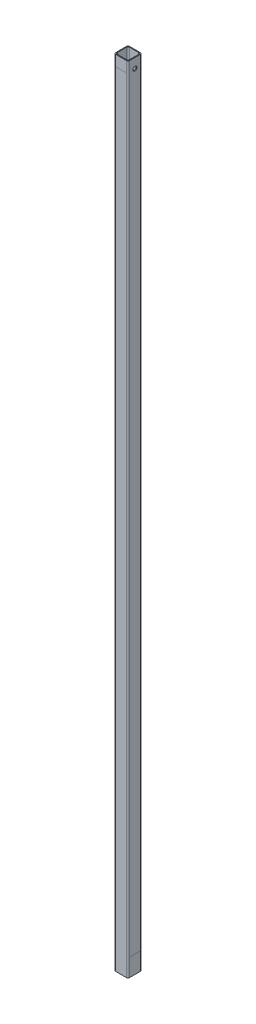
ISO-10303-21;
HEADER;
FILE_DESCRIPTION(('STEP AP214'),'2;1');
FILE_NAME('part.step','',(''),(''),'','','');
FILE_SCHEMA(('AUTOMOTIVE_DESIGN { 1 0 10303 214 1 1 1 1 }'));
ENDSEC;
DATA;
#1=APPLICATION_CONTEXT('core data for automotive mechanical design processes');
#2=APPLICATION_PROTOCOL_DEFINITION('international standard','automotive_design',2000,#1);
#3=PRODUCT_CONTEXT('',#1,'mechanical');
#4=PRODUCT('Part','Part','',(#3));
#5=PRODUCT_RELATED_PRODUCT_CATEGORY('part','',(#4));
#6=PRODUCT_DEFINITION_FORMATION('','',#4);
#7=PRODUCT_DEFINITION_CONTEXT('part definition',#1,'design');
#8=PRODUCT_DEFINITION('design','',#6,#7);
#9=PRODUCT_DEFINITION_SHAPE('','',#8);
#10=(LENGTH_UNIT() NAMED_UNIT(*) SI_UNIT(.MILLI.,.METRE.));
#11=(NAMED_UNIT(*) PLANE_ANGLE_UNIT() SI_UNIT($,.RADIAN.));
#12=(NAMED_UNIT(*) SI_UNIT($,.STERADIAN.) SOLID_ANGLE_UNIT());
#13=UNCERTAINTY_MEASURE_WITH_UNIT(LENGTH_MEASURE(1.E-05),#10,'distance_accuracy_value','');
#14=(GEOMETRIC_REPRESENTATION_CONTEXT(3) GLOBAL_UNCERTAINTY_ASSIGNED_CONTEXT((#13)) GLOBAL_UNIT_ASSIGNED_CONTEXT((#10,
#11,#12)) REPRESENTATION_CONTEXT('',''));
#15=CARTESIAN_POINT('',(0.,0.,0.));
#16=DIRECTION('',(0.,0.,1.));
#17=DIRECTION('',(1.,0.,0.));
#18=AXIS2_PLACEMENT_3D('',#15,#16,#17);
#19=CARTESIAN_POINT('',(11.3411,1303.02,11.3411));
#20=DIRECTION('',(-1.,0.,0.));
#21=DIRECTION('',(0.,0.,1.));
#22=AXIS2_PLACEMENT_3D('',#19,#20,#21);
#23=PLANE('',#22);
#24=CARTESIAN_POINT('',(11.3411,1287.145,0.));
#25=DIRECTION('',(1.,0.,0.));
#26=DIRECTION('',(0.,0.,-1.));
#27=AXIS2_PLACEMENT_3D('',#24,#25,#26);
#28=CIRCLE('',#27,3.3782);
#29=CARTESIAN_POINT('',(11.3411,1287.145,-3.3782));
#30=VERTEX_POINT('',#29);
#31=EDGE_CURVE('E350',#30,#30,#28,.T.);
#32=ORIENTED_EDGE('',*,*,#31,.F.);
#33=EDGE_LOOP('',(#32));
#34=FACE_BOUND('',#33,.T.);
#35=DIRECTION('',(0.,0.,1.));
#36=VECTOR('',#35,1.);
#37=CARTESIAN_POINT('',(11.3411,29.0055034620877,11.3411));
#38=LINE('',#37,#36);
#39=CARTESIAN_POINT('',(11.3411,29.0055034620877,-8.8011));
#40=VERTEX_POINT('',#39);
#41=CARTESIAN_POINT('',(11.3411,29.0055034620877,8.8011));
#42=VERTEX_POINT('',#41);
#43=EDGE_CURVE('E11',#40,#42,#38,.T.);
#44=ORIENTED_EDGE('',*,*,#43,.F.);
#45=DIRECTION('',(0.,-1.,0.));
#46=VECTOR('',#45,1.);
#47=CARTESIAN_POINT('',(11.3411,1303.02,-8.8011));
#48=LINE('',#47,#46);
#49=CARTESIAN_POINT('',(11.3411,1303.02,-8.8011));
#50=VERTEX_POINT('',#49);
#51=EDGE_CURVE('E250',#40,#50,#48,.F.);
#52=ORIENTED_EDGE('',*,*,#51,.T.);
#53=DIRECTION('',(0.,0.,-1.));
#54=VECTOR('',#53,1.);
#55=CARTESIAN_POINT('',(11.3411,1303.02,11.3411));
#56=LINE('',#55,#54);
#57=CARTESIAN_POINT('',(11.3411,1303.02,8.8011));
#58=VERTEX_POINT('',#57);
#59=EDGE_CURVE('E304',#58,#50,#56,.T.);
#60=ORIENTED_EDGE('',*,*,#59,.F.);
#61=DIRECTION('',(0.,-1.,0.));
#62=VECTOR('',#61,1.);
#63=CARTESIAN_POINT('',(11.3411,1303.02,8.8011));
#64=LINE('',#63,#62);
#65=EDGE_CURVE('E254',#58,#42,#64,.T.);
#66=ORIENTED_EDGE('',*,*,#65,.T.);
#67=EDGE_LOOP('',(#44,#52,#60,#66));
#68=FACE_BOUND('',#67,.T.);
#69=ADVANCED_FACE('F37',(#34,#68),#23,.F.);
#70=CARTESIAN_POINT('',(-11.3411,1303.02,11.3411));
#71=DIRECTION('',(0.,0.,-1.));
#72=DIRECTION('',(-1.,0.,0.));
#73=AXIS2_PLACEMENT_3D('',#70,#71,#72);
#74=PLANE('',#73);
#75=DIRECTION('',(1.,0.,0.));
#76=VECTOR('',#75,1.);
#77=CARTESIAN_POINT('',(-11.3411,1285.4178,11.3411));
#78=LINE('',#77,#76);
#79=CARTESIAN_POINT('',(-8.8011,1285.4178,11.3411));
#80=VERTEX_POINT('',#79);
#81=CARTESIAN_POINT('',(8.8011,1285.4178,11.3411));
#82=VERTEX_POINT('',#81);
#83=EDGE_CURVE('E46',#80,#82,#78,.T.);
#84=ORIENTED_EDGE('',*,*,#83,.F.);
#85=DIRECTION('',(0.,-1.,0.));
#86=VECTOR('',#85,1.);
#87=CARTESIAN_POINT('',(-8.8011,1303.02,11.3411));
#88=LINE('',#87,#86);
#89=CARTESIAN_POINT('',(-8.8011,0.,11.3411));
#90=VERTEX_POINT('',#89);
#91=EDGE_CURVE('E225',#80,#90,#88,.T.);
#92=ORIENTED_EDGE('',*,*,#91,.T.);
#93=DIRECTION('',(1.,0.,0.));
#94=VECTOR('',#93,1.);
#95=CARTESIAN_POINT('',(-11.3411,0.,11.3411));
#96=LINE('',#95,#94);
#97=CARTESIAN_POINT('',(8.8011,0.,11.3411));
#98=VERTEX_POINT('',#97);
#99=EDGE_CURVE('E205',#90,#98,#96,.T.);
#100=ORIENTED_EDGE('',*,*,#99,.T.);
#101=DIRECTION('',(0.,-1.,0.));
#102=VECTOR('',#101,1.);
#103=CARTESIAN_POINT('',(8.8011,1303.02,11.3411));
#104=LINE('',#103,#102);
#105=EDGE_CURVE('E222',#98,#82,#104,.F.);
#106=ORIENTED_EDGE('',*,*,#105,.T.);
#107=EDGE_LOOP('',(#84,#92,#100,#106));
#108=FACE_BOUND('',#107,.T.);
#109=ADVANCED_FACE('F300',(#108),#74,.F.);
#110=CARTESIAN_POINT('',(-11.3411,1303.02,-11.3411));
#111=DIRECTION('',(0.,0.,1.));
#112=DIRECTION('',(1.,0.,0.));
#113=AXIS2_PLACEMENT_3D('',#110,#111,#112);
#114=PLANE('',#113);
#115=DIRECTION('',(-1.,0.,0.));
#116=VECTOR('',#115,1.);
#117=CARTESIAN_POINT('',(-11.3411,241.3,-11.3411));
#118=LINE('',#117,#116);
#119=CARTESIAN_POINT('',(8.8011,241.3,-11.3411));
#120=VERTEX_POINT('',#119);
#121=CARTESIAN_POINT('',(-8.8011,241.3,-11.3411));
#122=VERTEX_POINT('',#121);
#123=EDGE_CURVE('E281',#120,#122,#118,.T.);
#124=ORIENTED_EDGE('',*,*,#123,.F.);
#125=DIRECTION('',(0.,-1.,0.));
#126=VECTOR('',#125,1.);
#127=CARTESIAN_POINT('',(8.8011,1303.02,-11.3411));
#128=LINE('',#127,#126);
#129=CARTESIAN_POINT('',(8.8011,0.,-11.3411));
#130=VERTEX_POINT('',#129);
#131=EDGE_CURVE('E260',#120,#130,#128,.T.);
#132=ORIENTED_EDGE('',*,*,#131,.T.);
#133=DIRECTION('',(-1.,0.,0.));
#134=VECTOR('',#133,1.);
#135=CARTESIAN_POINT('',(-11.3411,0.,-11.3411));
#136=LINE('',#135,#134);
#137=CARTESIAN_POINT('',(-8.8011,0.,-11.3411));
#138=VERTEX_POINT('',#137);
#139=EDGE_CURVE('E310',#130,#138,#136,.T.);
#140=ORIENTED_EDGE('',*,*,#139,.T.);
#141=DIRECTION('',(0.,-1.,0.));
#142=VECTOR('',#141,1.);
#143=CARTESIAN_POINT('',(-8.8011,1303.02,-11.3411));
#144=LINE('',#143,#142);
#145=EDGE_CURVE('E257',#138,#122,#144,.F.);
#146=ORIENTED_EDGE('',*,*,#145,.T.);
#147=EDGE_LOOP('',(#124,#132,#140,#146));
#148=FACE_BOUND('',#147,.T.);
#149=ADVANCED_FACE('F362',(#148),#114,.F.);
#150=DIRECTION('',(1.,0.,0.));
#151=VECTOR('',#150,1.);
#152=CARTESIAN_POINT('',(-11.3411,258.9022,-11.3411));
#153=LINE('',#152,#151);
#154=CARTESIAN_POINT('',(-8.8011,258.9022,-11.3411));
#155=VERTEX_POINT('',#154);
#156=CARTESIAN_POINT('',(8.8011,258.9022,-11.3411));
#157=VERTEX_POINT('',#156);
#158=EDGE_CURVE('E278',#155,#157,#153,.T.);
#159=ORIENTED_EDGE('',*,*,#158,.F.);
#160=CARTESIAN_POINT('',(-8.8011,1303.02,-11.3411));
#161=VERTEX_POINT('',#160);
#162=EDGE_CURVE('E256',#155,#161,#144,.F.);
#163=ORIENTED_EDGE('',*,*,#162,.T.);
#164=DIRECTION('',(-1.,0.,0.));
#165=VECTOR('',#164,1.);
#166=CARTESIAN_POINT('',(-11.3411,1303.02,-11.3411));
#167=LINE('',#166,#165);
#168=CARTESIAN_POINT('',(8.8011,1303.02,-11.3411));
#169=VERTEX_POINT('',#168);
#170=EDGE_CURVE('E307',#169,#161,#167,.T.);
#171=ORIENTED_EDGE('',*,*,#170,.F.);
#172=EDGE_CURVE('E262',#169,#157,#128,.T.);
#173=ORIENTED_EDGE('',*,*,#172,.T.);
#174=EDGE_LOOP('',(#159,#163,#171,#173));
#175=FACE_BOUND('',#174,.T.);
#176=ADVANCED_FACE('F374',(#175),#114,.F.);
#177=CARTESIAN_POINT('',(0.,1303.02,0.));
#178=DIRECTION('',(0.,-1.,0.));
#179=DIRECTION('',(0.,0.,-1.));
#180=AXIS2_PLACEMENT_3D('',#177,#178,#179);
#181=PLANE('',#180);
#182=DIRECTION('',(0.,0.,1.));
#183=VECTOR('',#182,1.);
#184=CARTESIAN_POINT('',(-11.3411,1303.02,11.3411));
#185=LINE('',#184,#183);
#186=CARTESIAN_POINT('',(-11.3411,1303.02,-8.8011));
#187=VERTEX_POINT('',#186);
#188=CARTESIAN_POINT('',(-11.3411,1303.02,8.8011));
#189=VERTEX_POINT('',#188);
#190=EDGE_CURVE('E202',#187,#189,#185,.T.);
#191=ORIENTED_EDGE('',*,*,#190,.T.);
#192=CARTESIAN_POINT('',(-8.8011,1303.02,8.8011));
#193=DIRECTION('',(0.,-1.,0.));
#194=DIRECTION('',(0.,0.,-1.));
#195=AXIS2_PLACEMENT_3D('',#192,#193,#194);
#196=CIRCLE('',#195,2.54);
#197=CARTESIAN_POINT('',(-8.8011,1303.02,11.3411));
#198=VERTEX_POINT('',#197);
#199=EDGE_CURVE('E248',#189,#198,#196,.F.);
#200=ORIENTED_EDGE('',*,*,#199,.T.);
#201=DIRECTION('',(1.,0.,0.));
#202=VECTOR('',#201,1.);
#203=CARTESIAN_POINT('',(-11.3411,1303.02,11.3411));
#204=LINE('',#203,#202);
#205=CARTESIAN_POINT('',(8.8011,1303.02,11.3411));
#206=VERTEX_POINT('',#205);
#207=EDGE_CURVE('E197',#198,#206,#204,.T.);
#208=ORIENTED_EDGE('',*,*,#207,.T.);
#209=CARTESIAN_POINT('',(8.8011,1303.02,8.8011));
#210=DIRECTION('',(0.,-1.,0.));
#211=DIRECTION('',(0.,0.,-1.));
#212=AXIS2_PLACEMENT_3D('',#209,#210,#211);
#213=CIRCLE('',#212,2.54);
#214=EDGE_CURVE('E246',#206,#58,#213,.F.);
#215=ORIENTED_EDGE('',*,*,#214,.T.);
#216=ORIENTED_EDGE('',*,*,#59,.T.);
#217=CARTESIAN_POINT('',(8.8011,1303.02,-8.8011));
#218=DIRECTION('',(0.,-1.,0.));
#219=DIRECTION('',(0.,0.,-1.));
#220=AXIS2_PLACEMENT_3D('',#217,#218,#219);
#221=CIRCLE('',#220,2.54);
#222=EDGE_CURVE('E244',#50,#169,#221,.F.);
#223=ORIENTED_EDGE('',*,*,#222,.T.);
#224=ORIENTED_EDGE('',*,*,#170,.T.);
#225=CARTESIAN_POINT('',(-8.8011,1303.02,-8.8011));
#226=DIRECTION('',(0.,-1.,0.));
#227=DIRECTION('',(0.,0.,-1.));
#228=AXIS2_PLACEMENT_3D('',#225,#226,#227);
#229=CIRCLE('',#228,2.54);
#230=EDGE_CURVE('E242',#161,#187,#229,.F.);
#231=ORIENTED_EDGE('',*,*,#230,.T.);
#232=EDGE_LOOP('',(#191,#200,#208,#215,#216,#223,#224,#231));
#233=FACE_BOUND('',#232,.T.);
#234=DIRECTION('',(0.,0.,-1.));
#235=VECTOR('',#234,1.);
#236=CARTESIAN_POINT('',(10.0711,1303.02,10.0711));
#237=LINE('',#236,#235);
#238=CARTESIAN_POINT('',(10.0711,1303.02,7.5311));
#239=VERTEX_POINT('',#238);
#240=CARTESIAN_POINT('',(10.0711,1303.02,-7.5311));
#241=VERTEX_POINT('',#240);
#242=EDGE_CURVE('E326',#239,#241,#237,.T.);
#243=ORIENTED_EDGE('',*,*,#242,.F.);
#244=CARTESIAN_POINT('',(7.5311,1303.02,7.5311));
#245=DIRECTION('',(0.,-1.,0.));
#246=DIRECTION('',(0.,0.,-1.));
#247=AXIS2_PLACEMENT_3D('',#244,#245,#246);
#248=CIRCLE('',#247,2.54);
#249=CARTESIAN_POINT('',(7.5311,1303.02,10.0711));
#250=VERTEX_POINT('',#249);
#251=EDGE_CURVE('E183',#239,#250,#248,.T.);
#252=ORIENTED_EDGE('',*,*,#251,.T.);
#253=DIRECTION('',(1.,0.,0.));
#254=VECTOR('',#253,1.);
#255=CARTESIAN_POINT('',(-10.0711,1303.02,10.0711));
#256=LINE('',#255,#254);
#257=CARTESIAN_POINT('',(-7.5311,1303.02,10.0711));
#258=VERTEX_POINT('',#257);
#259=EDGE_CURVE('E319',#258,#250,#256,.T.);
#260=ORIENTED_EDGE('',*,*,#259,.F.);
#261=CARTESIAN_POINT('',(-7.5311,1303.02,7.5311));
#262=DIRECTION('',(0.,-1.,0.));
#263=DIRECTION('',(0.,0.,-1.));
#264=AXIS2_PLACEMENT_3D('',#261,#262,#263);
#265=CIRCLE('',#264,2.54);
#266=CARTESIAN_POINT('',(-10.0711,1303.02,7.5311));
#267=VERTEX_POINT('',#266);
#268=EDGE_CURVE('E268',#258,#267,#265,.T.);
#269=ORIENTED_EDGE('',*,*,#268,.T.);
#270=DIRECTION('',(0.,0.,1.));
#271=VECTOR('',#270,1.);
#272=CARTESIAN_POINT('',(-10.0711,1303.02,10.0711));
#273=LINE('',#272,#271);
#274=CARTESIAN_POINT('',(-10.0711,1303.02,-7.5311));
#275=VERTEX_POINT('',#274);
#276=EDGE_CURVE('E335',#275,#267,#273,.T.);
#277=ORIENTED_EDGE('',*,*,#276,.F.);
#278=CARTESIAN_POINT('',(-7.5311,1303.02,-7.5311));
#279=DIRECTION('',(0.,-1.,0.));
#280=DIRECTION('',(0.,0.,-1.));
#281=AXIS2_PLACEMENT_3D('',#278,#279,#280);
#282=CIRCLE('',#281,2.54);
#283=CARTESIAN_POINT('',(-7.5311,1303.02,-10.0711));
#284=VERTEX_POINT('',#283);
#285=EDGE_CURVE('E182',#275,#284,#282,.T.);
#286=ORIENTED_EDGE('',*,*,#285,.T.);
#287=DIRECTION('',(-1.,0.,0.));
#288=VECTOR('',#287,1.);
#289=CARTESIAN_POINT('',(-10.0711,1303.02,-10.0711));
#290=LINE('',#289,#288);
#291=CARTESIAN_POINT('',(7.5311,1303.02,-10.0711));
#292=VERTEX_POINT('',#291);
#293=EDGE_CURVE('E337',#292,#284,#290,.T.);
#294=ORIENTED_EDGE('',*,*,#293,.F.);
#295=CARTESIAN_POINT('',(7.5311,1303.02,-7.5311));
#296=DIRECTION('',(0.,-1.,0.));
#297=DIRECTION('',(0.,0.,-1.));
#298=AXIS2_PLACEMENT_3D('',#295,#296,#297);
#299=CIRCLE('',#298,2.54);
#300=EDGE_CURVE('E276',#292,#241,#299,.T.);
#301=ORIENTED_EDGE('',*,*,#300,.T.);
#302=EDGE_LOOP('',(#243,#252,#260,#269,#277,#286,#294,#301));
#303=FACE_BOUND('',#302,.T.);
#304=ADVANCED_FACE('F375',(#233,#303),#181,.F.);
#305=CARTESIAN_POINT('',(0.,0.,0.));
#306=DIRECTION('',(0.,-1.,0.));
#307=DIRECTION('',(0.,0.,-1.));
#308=AXIS2_PLACEMENT_3D('',#305,#306,#307);
#309=PLANE('',#308);
#310=ORIENTED_EDGE('',*,*,#99,.F.);
#311=CARTESIAN_POINT('',(-8.8011,0.,8.8011));
#312=DIRECTION('',(0.,-1.,0.));
#313=DIRECTION('',(0.,0.,-1.));
#314=AXIS2_PLACEMENT_3D('',#311,#312,#313);
#315=CIRCLE('',#314,2.54);
#316=CARTESIAN_POINT('',(-11.3411,0.,8.8011));
#317=VERTEX_POINT('',#316);
#318=EDGE_CURVE('E235',#90,#317,#315,.T.);
#319=ORIENTED_EDGE('',*,*,#318,.T.);
#320=DIRECTION('',(0.,0.,1.));
#321=VECTOR('',#320,1.);
#322=CARTESIAN_POINT('',(-11.3411,0.,11.3411));
#323=LINE('',#322,#321);
#324=CARTESIAN_POINT('',(-11.3411,0.,-8.8011));
#325=VERTEX_POINT('',#324);
#326=EDGE_CURVE('E305',#325,#317,#323,.T.);
#327=ORIENTED_EDGE('',*,*,#326,.F.);
#328=CARTESIAN_POINT('',(-8.8011,0.,-8.8011));
#329=DIRECTION('',(0.,-1.,0.));
#330=DIRECTION('',(0.,0.,-1.));
#331=AXIS2_PLACEMENT_3D('',#328,#329,#330);
#332=CIRCLE('',#331,2.54);
#333=EDGE_CURVE('E229',#325,#138,#332,.T.);
#334=ORIENTED_EDGE('',*,*,#333,.T.);
#335=ORIENTED_EDGE('',*,*,#139,.F.);
#336=CARTESIAN_POINT('',(8.8011,0.,-8.8011));
#337=DIRECTION('',(0.,-1.,0.));
#338=DIRECTION('',(0.,0.,-1.));
#339=AXIS2_PLACEMENT_3D('',#336,#337,#338);
#340=CIRCLE('',#339,2.54);
#341=CARTESIAN_POINT('',(11.3411,0.,-8.8011));
#342=VERTEX_POINT('',#341);
#343=EDGE_CURVE('E231',#130,#342,#340,.T.);
#344=ORIENTED_EDGE('',*,*,#343,.T.);
#345=DIRECTION('',(0.,0.,-1.));
#346=VECTOR('',#345,1.);
#347=CARTESIAN_POINT('',(11.3411,0.,11.3411));
#348=LINE('',#347,#346);
#349=CARTESIAN_POINT('',(11.3411,0.,8.8011));
#350=VERTEX_POINT('',#349);
#351=EDGE_CURVE('E315',#350,#342,#348,.T.);
#352=ORIENTED_EDGE('',*,*,#351,.F.);
#353=CARTESIAN_POINT('',(8.8011,0.,8.8011));
#354=DIRECTION('',(0.,-1.,0.));
#355=DIRECTION('',(0.,0.,-1.));
#356=AXIS2_PLACEMENT_3D('',#353,#354,#355);
#357=CIRCLE('',#356,2.54);
#358=EDGE_CURVE('E233',#350,#98,#357,.T.);
#359=ORIENTED_EDGE('',*,*,#358,.T.);
#360=EDGE_LOOP('',(#310,#319,#327,#334,#335,#344,#352,#359));
#361=FACE_BOUND('',#360,.T.);
#362=DIRECTION('',(0.,0.,1.));
#363=VECTOR('',#362,1.);
#364=CARTESIAN_POINT('',(-10.0711,0.,10.0711));
#365=LINE('',#364,#363);
#366=CARTESIAN_POINT('',(-10.0711,0.,-7.5311));
#367=VERTEX_POINT('',#366);
#368=CARTESIAN_POINT('',(-10.0711,0.,7.5311));
#369=VERTEX_POINT('',#368);
#370=EDGE_CURVE('E175',#367,#369,#365,.T.);
#371=ORIENTED_EDGE('',*,*,#370,.T.);
#372=CARTESIAN_POINT('',(-7.5311,0.,7.5311));
#373=DIRECTION('',(0.,-1.,0.));
#374=DIRECTION('',(0.,0.,-1.));
#375=AXIS2_PLACEMENT_3D('',#372,#373,#374);
#376=CIRCLE('',#375,2.54);
#377=CARTESIAN_POINT('',(-7.5311,0.,10.0711));
#378=VERTEX_POINT('',#377);
#379=EDGE_CURVE('E265',#369,#378,#376,.F.);
#380=ORIENTED_EDGE('',*,*,#379,.T.);
#381=DIRECTION('',(1.,0.,0.));
#382=VECTOR('',#381,1.);
#383=CARTESIAN_POINT('',(-10.0711,0.,10.0711));
#384=LINE('',#383,#382);
#385=CARTESIAN_POINT('',(7.5311,0.,10.0711));
#386=VERTEX_POINT('',#385);
#387=EDGE_CURVE('E193',#378,#386,#384,.T.);
#388=ORIENTED_EDGE('',*,*,#387,.T.);
#389=CARTESIAN_POINT('',(7.5311,0.,7.5311));
#390=DIRECTION('',(0.,-1.,0.));
#391=DIRECTION('',(0.,0.,-1.));
#392=AXIS2_PLACEMENT_3D('',#389,#390,#391);
#393=CIRCLE('',#392,2.54);
#394=CARTESIAN_POINT('',(10.0711,0.,7.5311));
#395=VERTEX_POINT('',#394);
#396=EDGE_CURVE('E270',#386,#395,#393,.F.);
#397=ORIENTED_EDGE('',*,*,#396,.T.);
#398=DIRECTION('',(0.,0.,-1.));
#399=VECTOR('',#398,1.);
#400=CARTESIAN_POINT('',(10.0711,0.,10.0711));
#401=LINE('',#400,#399);
#402=CARTESIAN_POINT('',(10.0711,0.,-7.5311));
#403=VERTEX_POINT('',#402);
#404=EDGE_CURVE('E329',#395,#403,#401,.T.);
#405=ORIENTED_EDGE('',*,*,#404,.T.);
#406=CARTESIAN_POINT('',(7.5311,0.,-7.5311));
#407=DIRECTION('',(0.,-1.,0.));
#408=DIRECTION('',(0.,0.,-1.));
#409=AXIS2_PLACEMENT_3D('',#406,#407,#408);
#410=CIRCLE('',#409,2.54);
#411=CARTESIAN_POINT('',(7.5311,0.,-10.0711));
#412=VERTEX_POINT('',#411);
#413=EDGE_CURVE('E274',#403,#412,#410,.F.);
#414=ORIENTED_EDGE('',*,*,#413,.T.);
#415=DIRECTION('',(-1.,0.,0.));
#416=VECTOR('',#415,1.);
#417=CARTESIAN_POINT('',(-10.0711,0.,-10.0711));
#418=LINE('',#417,#416);
#419=CARTESIAN_POINT('',(-7.5311,0.,-10.0711));
#420=VERTEX_POINT('',#419);
#421=EDGE_CURVE('E177',#412,#420,#418,.T.);
#422=ORIENTED_EDGE('',*,*,#421,.T.);
#423=CARTESIAN_POINT('',(-7.5311,0.,-7.5311));
#424=DIRECTION('',(0.,-1.,0.));
#425=DIRECTION('',(0.,0.,-1.));
#426=AXIS2_PLACEMENT_3D('',#423,#424,#425);
#427=CIRCLE('',#426,2.54);
#428=EDGE_CURVE('E172',#420,#367,#427,.F.);
#429=ORIENTED_EDGE('',*,*,#428,.T.);
#430=EDGE_LOOP('',(#371,#380,#388,#397,#405,#414,#422,#429));
#431=FACE_BOUND('',#430,.T.);
#432=ADVANCED_FACE('F174',(#361,#431),#309,.T.);
#433=EDGE_CURVE('E251',#342,#40,#48,.F.);
#434=ORIENTED_EDGE('',*,*,#433,.T.);
#435=ORIENTED_EDGE('',*,*,#43,.T.);
#436=EDGE_CURVE('E253',#42,#350,#64,.T.);
#437=ORIENTED_EDGE('',*,*,#436,.T.);
#438=ORIENTED_EDGE('',*,*,#351,.T.);
#439=EDGE_LOOP('',(#434,#435,#437,#438));
#440=FACE_BOUND('',#439,.T.);
#441=ADVANCED_FACE('F358',(#440),#23,.F.);
#442=EDGE_CURVE('E266',#157,#120,#128,.T.);
#443=ORIENTED_EDGE('',*,*,#442,.T.);
#444=ORIENTED_EDGE('',*,*,#123,.T.);
#445=EDGE_CURVE('E261',#122,#155,#144,.F.);
#446=ORIENTED_EDGE('',*,*,#445,.T.);
#447=ORIENTED_EDGE('',*,*,#158,.T.);
#448=EDGE_LOOP('',(#443,#444,#446,#447));
#449=FACE_BOUND('',#448,.T.);
#450=ADVANCED_FACE('F367',(#449),#114,.F.);
#451=CARTESIAN_POINT('',(-11.3411,1303.02,11.3411));
#452=DIRECTION('',(1.,0.,0.));
#453=DIRECTION('',(0.,0.,-1.));
#454=AXIS2_PLACEMENT_3D('',#451,#452,#453);
#455=PLANE('',#454);
#456=CARTESIAN_POINT('',(-11.3411,1287.145,0.));
#457=DIRECTION('',(1.,0.,0.));
#458=DIRECTION('',(0.,0.,-1.));
#459=AXIS2_PLACEMENT_3D('',#456,#457,#458);
#460=CIRCLE('',#459,3.3782);
#461=CARTESIAN_POINT('',(-11.3411,1287.145,-3.3782));
#462=VERTEX_POINT('',#461);
#463=EDGE_CURVE('E347',#462,#462,#460,.T.);
#464=ORIENTED_EDGE('',*,*,#463,.T.);
#465=EDGE_LOOP('',(#464));
#466=FACE_BOUND('',#465,.T.);
#467=ORIENTED_EDGE('',*,*,#326,.T.);
#468=DIRECTION('',(0.,-1.,0.));
#469=VECTOR('',#468,1.);
#470=CARTESIAN_POINT('',(-11.3411,1303.02,8.8011));
#471=LINE('',#470,#469);
#472=EDGE_CURVE('E240',#317,#189,#471,.F.);
#473=ORIENTED_EDGE('',*,*,#472,.T.);
#474=ORIENTED_EDGE('',*,*,#190,.F.);
#475=DIRECTION('',(0.,-1.,0.));
#476=VECTOR('',#475,1.);
#477=CARTESIAN_POINT('',(-11.3411,1303.02,-8.8011));
#478=LINE('',#477,#476);
#479=EDGE_CURVE('E237',#187,#325,#478,.T.);
#480=ORIENTED_EDGE('',*,*,#479,.T.);
#481=EDGE_LOOP('',(#467,#473,#474,#480));
#482=FACE_BOUND('',#481,.T.);
#483=ADVANCED_FACE('F372',(#466,#482),#455,.F.);
#484=EDGE_CURVE('E226',#198,#80,#88,.T.);
#485=ORIENTED_EDGE('',*,*,#484,.T.);
#486=ORIENTED_EDGE('',*,*,#83,.T.);
#487=EDGE_CURVE('E221',#82,#206,#104,.F.);
#488=ORIENTED_EDGE('',*,*,#487,.T.);
#489=ORIENTED_EDGE('',*,*,#207,.F.);
#490=EDGE_LOOP('',(#485,#486,#488,#489));
#491=FACE_BOUND('',#490,.T.);
#492=ADVANCED_FACE('F288',(#491),#74,.F.);
#493=CARTESIAN_POINT('',(10.0711,1303.02,10.0711));
#494=DIRECTION('',(-1.,0.,0.));
#495=DIRECTION('',(0.,0.,1.));
#496=AXIS2_PLACEMENT_3D('',#493,#494,#495);
#497=PLANE('',#496);
#498=CARTESIAN_POINT('',(10.0711,1287.145,0.));
#499=DIRECTION('',(-1.,0.,0.));
#500=DIRECTION('',(0.,0.,1.));
#501=AXIS2_PLACEMENT_3D('',#498,#499,#500);
#502=CIRCLE('',#501,3.3782);
#503=CARTESIAN_POINT('',(10.0711,1287.145,3.3782));
#504=VERTEX_POINT('',#503);
#505=EDGE_CURVE('E344',#504,#504,#502,.T.);
#506=ORIENTED_EDGE('',*,*,#505,.F.);
#507=EDGE_LOOP('',(#506));
#508=FACE_BOUND('',#507,.T.);
#509=ORIENTED_EDGE('',*,*,#404,.F.);
#510=DIRECTION('',(0.,-1.,0.));
#511=VECTOR('',#510,1.);
#512=CARTESIAN_POINT('',(10.0711,1303.02,7.5311));
#513=LINE('',#512,#511);
#514=EDGE_CURVE('E215',#395,#239,#513,.F.);
#515=ORIENTED_EDGE('',*,*,#514,.T.);
#516=ORIENTED_EDGE('',*,*,#242,.T.);
#517=DIRECTION('',(0.,-1.,0.));
#518=VECTOR('',#517,1.);
#519=CARTESIAN_POINT('',(10.0711,0.,-7.5311));
#520=LINE('',#519,#518);
#521=EDGE_CURVE('E212',#241,#403,#520,.T.);
#522=ORIENTED_EDGE('',*,*,#521,.T.);
#523=EDGE_LOOP('',(#509,#515,#516,#522));
#524=FACE_BOUND('',#523,.T.);
#525=ADVANCED_FACE('F409',(#508,#524),#497,.T.);
#526=CARTESIAN_POINT('',(-10.0711,1303.02,-10.0711));
#527=DIRECTION('',(0.,0.,1.));
#528=DIRECTION('',(1.,0.,0.));
#529=AXIS2_PLACEMENT_3D('',#526,#527,#528);
#530=PLANE('',#529);
#531=ORIENTED_EDGE('',*,*,#293,.T.);
#532=DIRECTION('',(0.,-1.,0.));
#533=VECTOR('',#532,1.);
#534=CARTESIAN_POINT('',(-7.5311,0.,-10.0711));
#535=LINE('',#534,#533);
#536=EDGE_CURVE('E219',#284,#420,#535,.T.);
#537=ORIENTED_EDGE('',*,*,#536,.T.);
#538=ORIENTED_EDGE('',*,*,#421,.F.);
#539=DIRECTION('',(0.,-1.,0.));
#540=VECTOR('',#539,1.);
#541=CARTESIAN_POINT('',(7.5311,1303.02,-10.0711));
#542=LINE('',#541,#540);
#543=EDGE_CURVE('E217',#412,#292,#542,.F.);
#544=ORIENTED_EDGE('',*,*,#543,.T.);
#545=EDGE_LOOP('',(#531,#537,#538,#544));
#546=FACE_BOUND('',#545,.T.);
#547=ADVANCED_FACE('F415',(#546),#530,.T.);
#548=CARTESIAN_POINT('',(-10.0711,1303.02,10.0711));
#549=DIRECTION('',(1.,0.,0.));
#550=DIRECTION('',(0.,0.,-1.));
#551=AXIS2_PLACEMENT_3D('',#548,#549,#550);
#552=PLANE('',#551);
#553=CARTESIAN_POINT('',(-10.0711,1287.145,0.));
#554=DIRECTION('',(1.,0.,0.));
#555=DIRECTION('',(0.,0.,-1.));
#556=AXIS2_PLACEMENT_3D('',#553,#554,#555);
#557=CIRCLE('',#556,3.3782);
#558=CARTESIAN_POINT('',(-10.0711,1287.145,-3.3782));
#559=VERTEX_POINT('',#558);
#560=EDGE_CURVE('E332',#559,#559,#557,.T.);
#561=ORIENTED_EDGE('',*,*,#560,.F.);
#562=EDGE_LOOP('',(#561));
#563=FACE_BOUND('',#562,.T.);
#564=ORIENTED_EDGE('',*,*,#276,.T.);
#565=DIRECTION('',(0.,-1.,0.));
#566=VECTOR('',#565,1.);
#567=CARTESIAN_POINT('',(-10.0711,0.,7.5311));
#568=LINE('',#567,#566);
#569=EDGE_CURVE('E192',#267,#369,#568,.T.);
#570=ORIENTED_EDGE('',*,*,#569,.T.);
#571=ORIENTED_EDGE('',*,*,#370,.F.);
#572=DIRECTION('',(0.,-1.,0.));
#573=VECTOR('',#572,1.);
#574=CARTESIAN_POINT('',(-10.0711,1303.02,-7.5311));
#575=LINE('',#574,#573);
#576=EDGE_CURVE('E189',#367,#275,#575,.F.);
#577=ORIENTED_EDGE('',*,*,#576,.T.);
#578=EDGE_LOOP('',(#564,#570,#571,#577));
#579=FACE_BOUND('',#578,.T.);
#580=ADVANCED_FACE('F188',(#563,#579),#552,.T.);
#581=CARTESIAN_POINT('',(-10.0711,1303.02,10.0711));
#582=DIRECTION('',(0.,0.,-1.));
#583=DIRECTION('',(-1.,0.,0.));
#584=AXIS2_PLACEMENT_3D('',#581,#582,#583);
#585=PLANE('',#584);
#586=ORIENTED_EDGE('',*,*,#387,.F.);
#587=DIRECTION('',(0.,-1.,0.));
#588=VECTOR('',#587,1.);
#589=CARTESIAN_POINT('',(-7.5311,1303.02,10.0711));
#590=LINE('',#589,#588);
#591=EDGE_CURVE('E210',#378,#258,#590,.F.);
#592=ORIENTED_EDGE('',*,*,#591,.T.);
#593=ORIENTED_EDGE('',*,*,#259,.T.);
#594=DIRECTION('',(0.,-1.,0.));
#595=VECTOR('',#594,1.);
#596=CARTESIAN_POINT('',(7.5311,0.,10.0711));
#597=LINE('',#596,#595);
#598=EDGE_CURVE('E199',#250,#386,#597,.T.);
#599=ORIENTED_EDGE('',*,*,#598,.T.);
#600=EDGE_LOOP('',(#586,#592,#593,#599));
#601=FACE_BOUND('',#600,.T.);
#602=ADVANCED_FACE('F422',(#601),#585,.T.);
#603=CARTESIAN_POINT('',(-7.5311,1303.02,7.5311));
#604=DIRECTION('',(0.,1.,0.));
#605=DIRECTION('',(0.,0.,1.));
#606=AXIS2_PLACEMENT_3D('',#603,#604,#605);
#607=CYLINDRICAL_SURFACE('',#606,2.54);
#608=ORIENTED_EDGE('',*,*,#268,.F.);
#609=ORIENTED_EDGE('',*,*,#591,.F.);
#610=ORIENTED_EDGE('',*,*,#379,.F.);
#611=ORIENTED_EDGE('',*,*,#569,.F.);
#612=EDGE_LOOP('',(#608,#609,#610,#611));
#613=FACE_BOUND('',#612,.T.);
#614=ADVANCED_FACE('F426',(#613),#607,.F.);
#615=CARTESIAN_POINT('',(7.5311,1303.02,7.5311));
#616=DIRECTION('',(0.,1.,0.));
#617=DIRECTION('',(0.,0.,1.));
#618=AXIS2_PLACEMENT_3D('',#615,#616,#617);
#619=CYLINDRICAL_SURFACE('',#618,2.54);
#620=ORIENTED_EDGE('',*,*,#251,.F.);
#621=ORIENTED_EDGE('',*,*,#514,.F.);
#622=ORIENTED_EDGE('',*,*,#396,.F.);
#623=ORIENTED_EDGE('',*,*,#598,.F.);
#624=EDGE_LOOP('',(#620,#621,#622,#623));
#625=FACE_BOUND('',#624,.T.);
#626=ADVANCED_FACE('F444',(#625),#619,.F.);
#627=CARTESIAN_POINT('',(-7.5311,1303.02,-7.5311));
#628=DIRECTION('',(0.,1.,0.));
#629=DIRECTION('',(0.,0.,1.));
#630=AXIS2_PLACEMENT_3D('',#627,#628,#629);
#631=CYLINDRICAL_SURFACE('',#630,2.54);
#632=ORIENTED_EDGE('',*,*,#285,.F.);
#633=ORIENTED_EDGE('',*,*,#576,.F.);
#634=ORIENTED_EDGE('',*,*,#428,.F.);
#635=ORIENTED_EDGE('',*,*,#536,.F.);
#636=EDGE_LOOP('',(#632,#633,#634,#635));
#637=FACE_BOUND('',#636,.T.);
#638=ADVANCED_FACE('F196',(#637),#631,.F.);
#639=CARTESIAN_POINT('',(7.5311,1303.02,-7.5311));
#640=DIRECTION('',(0.,1.,0.));
#641=DIRECTION('',(0.,0.,1.));
#642=AXIS2_PLACEMENT_3D('',#639,#640,#641);
#643=CYLINDRICAL_SURFACE('',#642,2.54);
#644=ORIENTED_EDGE('',*,*,#300,.F.);
#645=ORIENTED_EDGE('',*,*,#543,.F.);
#646=ORIENTED_EDGE('',*,*,#413,.F.);
#647=ORIENTED_EDGE('',*,*,#521,.F.);
#648=EDGE_LOOP('',(#644,#645,#646,#647));
#649=FACE_BOUND('',#648,.T.);
#650=ADVANCED_FACE('F455',(#649),#643,.F.);
#651=CARTESIAN_POINT('',(-8.8011,1303.02,8.8011));
#652=DIRECTION('',(0.,-1.,0.));
#653=DIRECTION('',(0.,0.,-1.));
#654=AXIS2_PLACEMENT_3D('',#651,#652,#653);
#655=CYLINDRICAL_SURFACE('',#654,2.54);
#656=ORIENTED_EDGE('',*,*,#199,.F.);
#657=ORIENTED_EDGE('',*,*,#472,.F.);
#658=ORIENTED_EDGE('',*,*,#318,.F.);
#659=ORIENTED_EDGE('',*,*,#91,.F.);
#660=ORIENTED_EDGE('',*,*,#484,.F.);
#661=EDGE_LOOP('',(#656,#657,#658,#659,#660));
#662=FACE_BOUND('',#661,.T.);
#663=ADVANCED_FACE('F392',(#662),#655,.T.);
#664=CARTESIAN_POINT('',(8.8011,1303.02,8.8011));
#665=DIRECTION('',(0.,-1.,0.));
#666=DIRECTION('',(0.,0.,-1.));
#667=AXIS2_PLACEMENT_3D('',#664,#665,#666);
#668=CYLINDRICAL_SURFACE('',#667,2.54);
#669=ORIENTED_EDGE('',*,*,#214,.F.);
#670=ORIENTED_EDGE('',*,*,#487,.F.);
#671=ORIENTED_EDGE('',*,*,#105,.F.);
#672=ORIENTED_EDGE('',*,*,#358,.F.);
#673=ORIENTED_EDGE('',*,*,#436,.F.);
#674=ORIENTED_EDGE('',*,*,#65,.F.);
#675=EDGE_LOOP('',(#669,#670,#671,#672,#673,#674));
#676=FACE_BOUND('',#675,.T.);
#677=ADVANCED_FACE('F296',(#676),#668,.T.);
#678=CARTESIAN_POINT('',(8.8011,1303.02,-8.8011));
#679=DIRECTION('',(0.,-1.,0.));
#680=DIRECTION('',(0.,0.,-1.));
#681=AXIS2_PLACEMENT_3D('',#678,#679,#680);
#682=CYLINDRICAL_SURFACE('',#681,2.54);
#683=ORIENTED_EDGE('',*,*,#222,.F.);
#684=ORIENTED_EDGE('',*,*,#51,.F.);
#685=ORIENTED_EDGE('',*,*,#433,.F.);
#686=ORIENTED_EDGE('',*,*,#343,.F.);
#687=ORIENTED_EDGE('',*,*,#131,.F.);
#688=ORIENTED_EDGE('',*,*,#442,.F.);
#689=ORIENTED_EDGE('',*,*,#172,.F.);
#690=EDGE_LOOP('',(#683,#684,#685,#686,#687,#688,#689));
#691=FACE_BOUND('',#690,.T.);
#692=ADVANCED_FACE('F382',(#691),#682,.T.);
#693=CARTESIAN_POINT('',(-8.8011,1303.02,-8.8011));
#694=DIRECTION('',(0.,-1.,0.));
#695=DIRECTION('',(0.,0.,-1.));
#696=AXIS2_PLACEMENT_3D('',#693,#694,#695);
#697=CYLINDRICAL_SURFACE('',#696,2.54);
#698=ORIENTED_EDGE('',*,*,#230,.F.);
#699=ORIENTED_EDGE('',*,*,#162,.F.);
#700=ORIENTED_EDGE('',*,*,#445,.F.);
#701=ORIENTED_EDGE('',*,*,#145,.F.);
#702=ORIENTED_EDGE('',*,*,#333,.F.);
#703=ORIENTED_EDGE('',*,*,#479,.F.);
#704=EDGE_LOOP('',(#698,#699,#700,#701,#702,#703));
#705=FACE_BOUND('',#704,.T.);
#706=ADVANCED_FACE('F39',(#705),#697,.T.);
#707=CARTESIAN_POINT('',(11.3411,1287.145,0.));
#708=DIRECTION('',(1.,0.,0.));
#709=DIRECTION('',(0.,0.,-1.));
#710=AXIS2_PLACEMENT_3D('',#707,#708,#709);
#711=CYLINDRICAL_SURFACE('',#710,3.3782);
#712=ORIENTED_EDGE('',*,*,#505,.T.);
#713=EDGE_LOOP('',(#712));
#714=FACE_BOUND('',#713,.T.);
#715=ORIENTED_EDGE('',*,*,#31,.T.);
#716=EDGE_LOOP('',(#715));
#717=FACE_BOUND('',#716,.T.);
#718=ADVANCED_FACE('F354',(#714,#717),#711,.F.);
#719=ORIENTED_EDGE('',*,*,#560,.T.);
#720=EDGE_LOOP('',(#719));
#721=FACE_BOUND('',#720,.T.);
#722=ORIENTED_EDGE('',*,*,#463,.F.);
#723=EDGE_LOOP('',(#722));
#724=FACE_BOUND('',#723,.T.);
#725=ADVANCED_FACE('F429',(#721,#724),#711,.F.);
#726=CLOSED_SHELL('',(#69,#109,#149,#176,#304,#432,#441,#450,#483,#492,#525,#547,#580,#602,#614,
#626,#638,#650,#663,#677,#692,#706,#718,#725));
#727=MANIFOLD_SOLID_BREP('B2',#726);
#728=ADVANCED_BREP_SHAPE_REPRESENTATION('',(#18,#727),#14);
#729=SHAPE_DEFINITION_REPRESENTATION(#9,#728);
ENDSEC;
END-ISO-10303-21;
